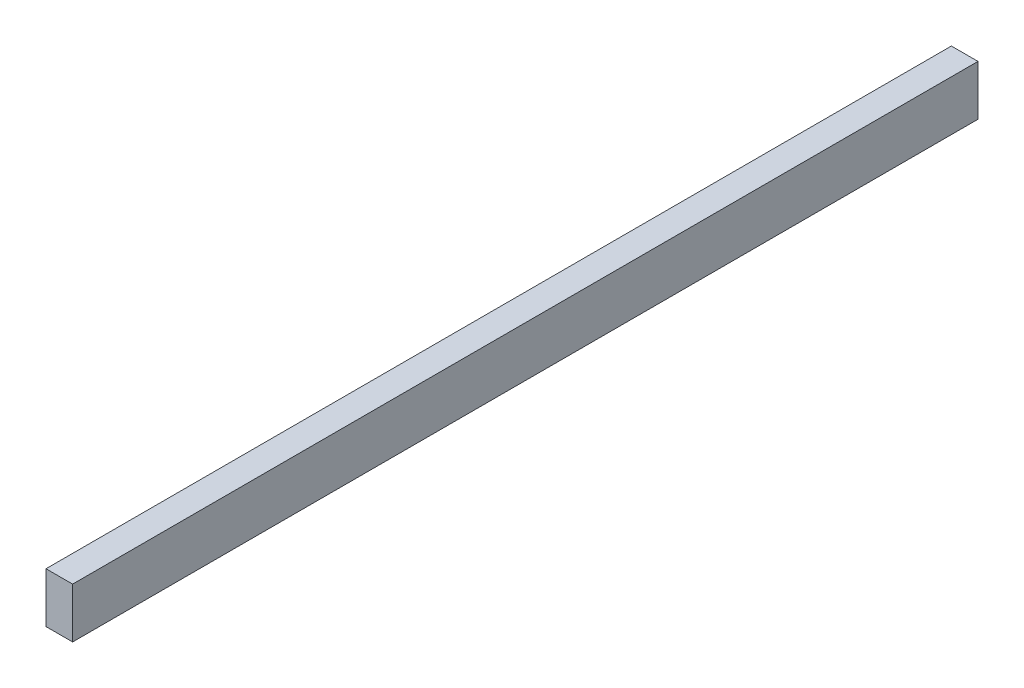
ISO-10303-21;
HEADER;
FILE_DESCRIPTION(('STEP AP214'),'2;1');
FILE_NAME('part.step','',(''),(''),'','','');
FILE_SCHEMA(('AUTOMOTIVE_DESIGN { 1 0 10303 214 1 1 1 1 }'));
ENDSEC;
DATA;
#1=APPLICATION_CONTEXT('core data for automotive mechanical design processes');
#2=APPLICATION_PROTOCOL_DEFINITION('international standard','automotive_design',2000,#1);
#3=PRODUCT_CONTEXT('',#1,'mechanical');
#4=PRODUCT('Part','Part','',(#3));
#5=PRODUCT_RELATED_PRODUCT_CATEGORY('part','',(#4));
#6=PRODUCT_DEFINITION_FORMATION('','',#4);
#7=PRODUCT_DEFINITION_CONTEXT('part definition',#1,'design');
#8=PRODUCT_DEFINITION('design','',#6,#7);
#9=PRODUCT_DEFINITION_SHAPE('','',#8);
#10=(LENGTH_UNIT() NAMED_UNIT(*) SI_UNIT(.MILLI.,.METRE.));
#11=(NAMED_UNIT(*) PLANE_ANGLE_UNIT() SI_UNIT($,.RADIAN.));
#12=(NAMED_UNIT(*) SI_UNIT($,.STERADIAN.) SOLID_ANGLE_UNIT());
#13=UNCERTAINTY_MEASURE_WITH_UNIT(LENGTH_MEASURE(1.E-05),#10,'distance_accuracy_value','');
#14=(GEOMETRIC_REPRESENTATION_CONTEXT(3) GLOBAL_UNCERTAINTY_ASSIGNED_CONTEXT((#13)) GLOBAL_UNIT_ASSIGNED_CONTEXT((#10,
#11,#12)) REPRESENTATION_CONTEXT('',''));
#15=CARTESIAN_POINT('',(0.,0.,0.));
#16=DIRECTION('',(0.,0.,1.));
#17=DIRECTION('',(1.,0.,0.));
#18=AXIS2_PLACEMENT_3D('',#15,#16,#17);
#19=CARTESIAN_POINT('',(-10.27,20.47,328.78));
#20=DIRECTION('',(0.,1.,0.));
#21=DIRECTION('',(0.,0.,1.));
#22=AXIS2_PLACEMENT_3D('',#19,#20,#21);
#23=PLANE('',#22);
#24=DIRECTION('',(1.,0.,0.));
#25=VECTOR('',#24,1.);
#26=CARTESIAN_POINT('',(-301.625,20.47,349.25));
#27=LINE('',#26,#25);
#28=CARTESIAN_POINT('',(-10.27,20.47,349.25));
#29=VERTEX_POINT('',#28);
#30=CARTESIAN_POINT('',(10.27,20.47,349.25));
#31=VERTEX_POINT('',#30);
#32=EDGE_CURVE('E86',#29,#31,#27,.T.);
#33=ORIENTED_EDGE('',*,*,#32,.F.);
#34=DIRECTION('',(0.,0.,1.));
#35=VECTOR('',#34,1.);
#36=CARTESIAN_POINT('',(-10.27,20.47,-349.25));
#37=LINE('',#36,#35);
#38=CARTESIAN_POINT('',(-10.27,20.47,-349.25));
#39=VERTEX_POINT('',#38);
#40=EDGE_CURVE('E43',#39,#29,#37,.T.);
#41=ORIENTED_EDGE('',*,*,#40,.F.);
#42=DIRECTION('',(-1.,0.,0.));
#43=VECTOR('',#42,1.);
#44=CARTESIAN_POINT('',(-301.625,20.47,-349.25));
#45=LINE('',#44,#43);
#46=CARTESIAN_POINT('',(10.27,20.47,-349.25));
#47=VERTEX_POINT('',#46);
#48=EDGE_CURVE('E52',#47,#39,#45,.T.);
#49=ORIENTED_EDGE('',*,*,#48,.F.);
#50=DIRECTION('',(0.,0.,-1.));
#51=VECTOR('',#50,1.);
#52=CARTESIAN_POINT('',(10.27,20.47,-349.25));
#53=LINE('',#52,#51);
#54=EDGE_CURVE('E11',#31,#47,#53,.T.);
#55=ORIENTED_EDGE('',*,*,#54,.F.);
#56=EDGE_LOOP('',(#33,#41,#49,#55));
#57=FACE_BOUND('',#56,.T.);
#58=ADVANCED_FACE('F34',(#57),#23,.F.);
#59=CARTESIAN_POINT('',(-301.625,20.47,349.25));
#60=DIRECTION('',(0.,0.,-1.));
#61=DIRECTION('',(-1.,0.,0.));
#62=AXIS2_PLACEMENT_3D('',#59,#60,#61);
#63=PLANE('',#62);
#64=DIRECTION('',(0.,-1.,0.));
#65=VECTOR('',#64,1.);
#66=CARTESIAN_POINT('',(-10.27,59.14,349.25));
#67=LINE('',#66,#65);
#68=CARTESIAN_POINT('',(-10.27,59.14,349.25));
#69=VERTEX_POINT('',#68);
#70=EDGE_CURVE('E82',#69,#29,#67,.T.);
#71=ORIENTED_EDGE('',*,*,#70,.T.);
#72=ORIENTED_EDGE('',*,*,#32,.T.);
#73=DIRECTION('',(0.,-1.,0.));
#74=VECTOR('',#73,1.);
#75=CARTESIAN_POINT('',(10.27,59.14,349.25));
#76=LINE('',#75,#74);
#77=CARTESIAN_POINT('',(10.27,59.14,349.25));
#78=VERTEX_POINT('',#77);
#79=EDGE_CURVE('E94',#78,#31,#76,.T.);
#80=ORIENTED_EDGE('',*,*,#79,.F.);
#81=DIRECTION('',(1.,0.,0.));
#82=VECTOR('',#81,1.);
#83=CARTESIAN_POINT('',(-10.27,59.14,349.25));
#84=LINE('',#83,#82);
#85=EDGE_CURVE('E93',#69,#78,#84,.T.);
#86=ORIENTED_EDGE('',*,*,#85,.F.);
#87=EDGE_LOOP('',(#71,#72,#80,#86));
#88=FACE_BOUND('',#87,.T.);
#89=ADVANCED_FACE('F92',(#88),#63,.F.);
#90=CARTESIAN_POINT('',(0.,59.14,0.));
#91=DIRECTION('',(0.,1.,0.));
#92=DIRECTION('',(0.,0.,1.));
#93=AXIS2_PLACEMENT_3D('',#90,#91,#92);
#94=PLANE('',#93);
#95=DIRECTION('',(0.,0.,-1.));
#96=VECTOR('',#95,1.);
#97=CARTESIAN_POINT('',(10.27,59.14,-349.25));
#98=LINE('',#97,#96);
#99=CARTESIAN_POINT('',(10.27,59.14,-349.25));
#100=VERTEX_POINT('',#99);
#101=EDGE_CURVE('E37',#78,#100,#98,.T.);
#102=ORIENTED_EDGE('',*,*,#101,.T.);
#103=DIRECTION('',(-1.,0.,0.));
#104=VECTOR('',#103,1.);
#105=CARTESIAN_POINT('',(-10.27,59.14,-349.25));
#106=LINE('',#105,#104);
#107=CARTESIAN_POINT('',(-10.27,59.14,-349.25));
#108=VERTEX_POINT('',#107);
#109=EDGE_CURVE('E67',#100,#108,#106,.T.);
#110=ORIENTED_EDGE('',*,*,#109,.T.);
#111=DIRECTION('',(0.,0.,1.));
#112=VECTOR('',#111,1.);
#113=CARTESIAN_POINT('',(-10.27,59.14,-349.25));
#114=LINE('',#113,#112);
#115=EDGE_CURVE('E101',#108,#69,#114,.T.);
#116=ORIENTED_EDGE('',*,*,#115,.T.);
#117=ORIENTED_EDGE('',*,*,#85,.T.);
#118=EDGE_LOOP('',(#102,#110,#116,#117));
#119=FACE_BOUND('',#118,.T.);
#120=ADVANCED_FACE('F104',(#119),#94,.T.);
#121=CARTESIAN_POINT('',(-301.625,20.47,-349.25));
#122=DIRECTION('',(0.,0.,1.));
#123=DIRECTION('',(1.,0.,0.));
#124=AXIS2_PLACEMENT_3D('',#121,#122,#123);
#125=PLANE('',#124);
#126=DIRECTION('',(0.,-1.,0.));
#127=VECTOR('',#126,1.);
#128=CARTESIAN_POINT('',(10.27,59.14,-349.25));
#129=LINE('',#128,#127);
#130=EDGE_CURVE('E90',#100,#47,#129,.T.);
#131=ORIENTED_EDGE('',*,*,#130,.T.);
#132=ORIENTED_EDGE('',*,*,#48,.T.);
#133=DIRECTION('',(0.,-1.,0.));
#134=VECTOR('',#133,1.);
#135=CARTESIAN_POINT('',(-10.27,59.14,-349.25));
#136=LINE('',#135,#134);
#137=EDGE_CURVE('E84',#108,#39,#136,.T.);
#138=ORIENTED_EDGE('',*,*,#137,.F.);
#139=ORIENTED_EDGE('',*,*,#109,.F.);
#140=EDGE_LOOP('',(#131,#132,#138,#139));
#141=FACE_BOUND('',#140,.T.);
#142=ADVANCED_FACE('F108',(#141),#125,.F.);
#143=CARTESIAN_POINT('',(10.27,59.14,-349.25));
#144=DIRECTION('',(-1.,0.,0.));
#145=DIRECTION('',(0.,0.,1.));
#146=AXIS2_PLACEMENT_3D('',#143,#144,#145);
#147=PLANE('',#146);
#148=ORIENTED_EDGE('',*,*,#79,.T.);
#149=ORIENTED_EDGE('',*,*,#54,.T.);
#150=ORIENTED_EDGE('',*,*,#130,.F.);
#151=ORIENTED_EDGE('',*,*,#101,.F.);
#152=EDGE_LOOP('',(#148,#149,#150,#151));
#153=FACE_BOUND('',#152,.T.);
#154=ADVANCED_FACE('F106',(#153),#147,.F.);
#155=CARTESIAN_POINT('',(-10.27,59.14,-349.25));
#156=DIRECTION('',(1.,0.,0.));
#157=DIRECTION('',(0.,0.,-1.));
#158=AXIS2_PLACEMENT_3D('',#155,#156,#157);
#159=PLANE('',#158);
#160=ORIENTED_EDGE('',*,*,#137,.T.);
#161=ORIENTED_EDGE('',*,*,#40,.T.);
#162=ORIENTED_EDGE('',*,*,#70,.F.);
#163=ORIENTED_EDGE('',*,*,#115,.F.);
#164=EDGE_LOOP('',(#160,#161,#162,#163));
#165=FACE_BOUND('',#164,.T.);
#166=ADVANCED_FACE('F79',(#165),#159,.F.);
#167=CLOSED_SHELL('',(#58,#89,#120,#142,#154,#166));
#168=MANIFOLD_SOLID_BREP('B2',#167);
#169=ADVANCED_BREP_SHAPE_REPRESENTATION('',(#18,#168),#14);
#170=SHAPE_DEFINITION_REPRESENTATION(#9,#169);
ENDSEC;
END-ISO-10303-21;
